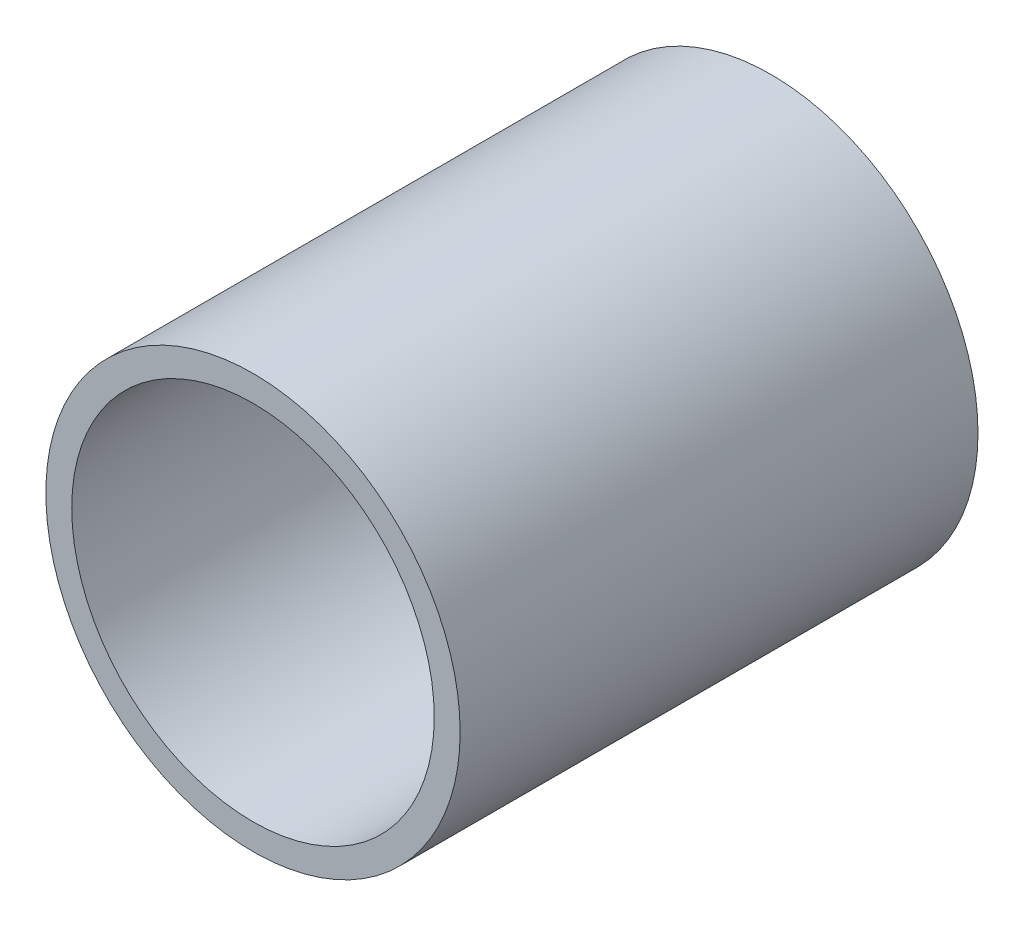
ISO-10303-21;
HEADER;
FILE_DESCRIPTION(('STEP AP214'),'2;1');
FILE_NAME('part.step','',(''),(''),'','','');
FILE_SCHEMA(('AUTOMOTIVE_DESIGN { 1 0 10303 214 1 1 1 1 }'));
ENDSEC;
DATA;
#1=APPLICATION_CONTEXT('core data for automotive mechanical design processes');
#2=APPLICATION_PROTOCOL_DEFINITION('international standard','automotive_design',2000,#1);
#3=PRODUCT_CONTEXT('',#1,'mechanical');
#4=PRODUCT('Part','Part','',(#3));
#5=PRODUCT_RELATED_PRODUCT_CATEGORY('part','',(#4));
#6=PRODUCT_DEFINITION_FORMATION('','',#4);
#7=PRODUCT_DEFINITION_CONTEXT('part definition',#1,'design');
#8=PRODUCT_DEFINITION('design','',#6,#7);
#9=PRODUCT_DEFINITION_SHAPE('','',#8);
#10=(LENGTH_UNIT() NAMED_UNIT(*) SI_UNIT(.MILLI.,.METRE.));
#11=(NAMED_UNIT(*) PLANE_ANGLE_UNIT() SI_UNIT($,.RADIAN.));
#12=(NAMED_UNIT(*) SI_UNIT($,.STERADIAN.) SOLID_ANGLE_UNIT());
#13=UNCERTAINTY_MEASURE_WITH_UNIT(LENGTH_MEASURE(1.E-05),#10,'distance_accuracy_value','');
#14=(GEOMETRIC_REPRESENTATION_CONTEXT(3) GLOBAL_UNCERTAINTY_ASSIGNED_CONTEXT((#13)) GLOBAL_UNIT_ASSIGNED_CONTEXT((#10,
#11,#12)) REPRESENTATION_CONTEXT('',''));
#15=CARTESIAN_POINT('',(0.,0.,0.));
#16=DIRECTION('',(0.,0.,1.));
#17=DIRECTION('',(1.,0.,0.));
#18=AXIS2_PLACEMENT_3D('',#15,#16,#17);
#19=CARTESIAN_POINT('',(0.,0.,40.));
#20=DIRECTION('',(0.,0.,-1.));
#21=DIRECTION('',(-1.,0.,0.));
#22=AXIS2_PLACEMENT_3D('',#19,#20,#21);
#23=CYLINDRICAL_SURFACE('',#22,16.);
#24=CARTESIAN_POINT('',(0.,0.,40.));
#25=DIRECTION('',(0.,0.,1.));
#26=DIRECTION('',(1.,0.,0.));
#27=AXIS2_PLACEMENT_3D('',#24,#25,#26);
#28=CIRCLE('',#27,16.);
#29=CARTESIAN_POINT('',(16.,0.,40.));
#30=VERTEX_POINT('',#29);
#31=EDGE_CURVE('E10',#30,#30,#28,.T.);
#32=ORIENTED_EDGE('',*,*,#31,.F.);
#33=EDGE_LOOP('',(#32));
#34=FACE_BOUND('',#33,.T.);
#35=CARTESIAN_POINT('',(0.,0.,0.));
#36=DIRECTION('',(0.,0.,1.));
#37=DIRECTION('',(1.,0.,0.));
#38=AXIS2_PLACEMENT_3D('',#35,#36,#37);
#39=CIRCLE('',#38,16.);
#40=CARTESIAN_POINT('',(16.,0.,0.));
#41=VERTEX_POINT('',#40);
#42=EDGE_CURVE('E36',#41,#41,#39,.T.);
#43=ORIENTED_EDGE('',*,*,#42,.T.);
#44=EDGE_LOOP('',(#43));
#45=FACE_BOUND('',#44,.T.);
#46=ADVANCED_FACE('F33',(#34,#45),#23,.T.);
#47=CARTESIAN_POINT('',(0.,0.,40.));
#48=DIRECTION('',(0.,0.,1.));
#49=DIRECTION('',(1.,0.,0.));
#50=AXIS2_PLACEMENT_3D('',#47,#48,#49);
#51=PLANE('',#50);
#52=CARTESIAN_POINT('',(0.,0.,40.));
#53=DIRECTION('',(0.,0.,-1.));
#54=DIRECTION('',(-1.,0.,0.));
#55=AXIS2_PLACEMENT_3D('',#52,#53,#54);
#56=CIRCLE('',#55,14.);
#57=CARTESIAN_POINT('',(-14.,0.,40.));
#58=VERTEX_POINT('',#57);
#59=EDGE_CURVE('E43',#58,#58,#56,.T.);
#60=ORIENTED_EDGE('',*,*,#59,.T.);
#61=EDGE_LOOP('',(#60));
#62=FACE_BOUND('',#61,.T.);
#63=ORIENTED_EDGE('',*,*,#31,.T.);
#64=EDGE_LOOP('',(#63));
#65=FACE_BOUND('',#64,.T.);
#66=ADVANCED_FACE('F51',(#62,#65),#51,.T.);
#67=CARTESIAN_POINT('',(0.,0.,0.));
#68=DIRECTION('',(0.,0.,1.));
#69=DIRECTION('',(1.,0.,0.));
#70=AXIS2_PLACEMENT_3D('',#67,#68,#69);
#71=PLANE('',#70);
#72=CARTESIAN_POINT('',(0.,0.,0.));
#73=DIRECTION('',(0.,0.,-1.));
#74=DIRECTION('',(-1.,0.,0.));
#75=AXIS2_PLACEMENT_3D('',#72,#73,#74);
#76=CIRCLE('',#75,14.);
#77=CARTESIAN_POINT('',(-14.,0.,0.));
#78=VERTEX_POINT('',#77);
#79=EDGE_CURVE('E45',#78,#78,#76,.T.);
#80=ORIENTED_EDGE('',*,*,#79,.F.);
#81=EDGE_LOOP('',(#80));
#82=FACE_BOUND('',#81,.T.);
#83=ORIENTED_EDGE('',*,*,#42,.F.);
#84=EDGE_LOOP('',(#83));
#85=FACE_BOUND('',#84,.T.);
#86=ADVANCED_FACE('F56',(#82,#85),#71,.F.);
#87=CARTESIAN_POINT('',(0.,0.,40.));
#88=DIRECTION('',(0.,0.,-1.));
#89=DIRECTION('',(-1.,0.,0.));
#90=AXIS2_PLACEMENT_3D('',#87,#88,#89);
#91=CYLINDRICAL_SURFACE('',#90,14.);
#92=ORIENTED_EDGE('',*,*,#59,.F.);
#93=EDGE_LOOP('',(#92));
#94=FACE_BOUND('',#93,.T.);
#95=ORIENTED_EDGE('',*,*,#79,.T.);
#96=EDGE_LOOP('',(#95));
#97=FACE_BOUND('',#96,.T.);
#98=ADVANCED_FACE('F53',(#94,#97),#91,.F.);
#99=CLOSED_SHELL('',(#46,#66,#86,#98));
#100=MANIFOLD_SOLID_BREP('B2',#99);
#101=ADVANCED_BREP_SHAPE_REPRESENTATION('',(#18,#100),#14);
#102=SHAPE_DEFINITION_REPRESENTATION(#9,#101);
ENDSEC;
END-ISO-10303-21;
